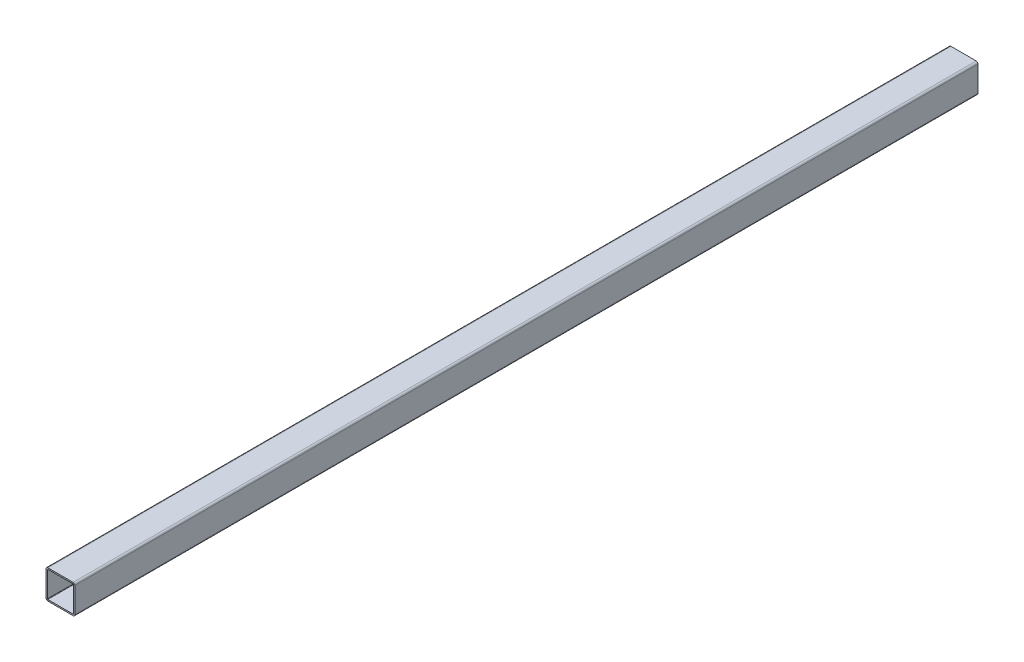
ISO-10303-21;
HEADER;
FILE_DESCRIPTION(('STEP AP214'),'2;1');
FILE_NAME('part.step','',(''),(''),'','','');
FILE_SCHEMA(('AUTOMOTIVE_DESIGN { 1 0 10303 214 1 1 1 1 }'));
ENDSEC;
DATA;
#1=APPLICATION_CONTEXT('core data for automotive mechanical design processes');
#2=APPLICATION_PROTOCOL_DEFINITION('international standard','automotive_design',2000,#1);
#3=PRODUCT_CONTEXT('',#1,'mechanical');
#4=PRODUCT('Part','Part','',(#3));
#5=PRODUCT_RELATED_PRODUCT_CATEGORY('part','',(#4));
#6=PRODUCT_DEFINITION_FORMATION('','',#4);
#7=PRODUCT_DEFINITION_CONTEXT('part definition',#1,'design');
#8=PRODUCT_DEFINITION('design','',#6,#7);
#9=PRODUCT_DEFINITION_SHAPE('','',#8);
#10=(LENGTH_UNIT() NAMED_UNIT(*) SI_UNIT(.MILLI.,.METRE.));
#11=(NAMED_UNIT(*) PLANE_ANGLE_UNIT() SI_UNIT($,.RADIAN.));
#12=(NAMED_UNIT(*) SI_UNIT($,.STERADIAN.) SOLID_ANGLE_UNIT());
#13=UNCERTAINTY_MEASURE_WITH_UNIT(LENGTH_MEASURE(1.E-05),#10,'distance_accuracy_value','');
#14=(GEOMETRIC_REPRESENTATION_CONTEXT(3) GLOBAL_UNCERTAINTY_ASSIGNED_CONTEXT((#13)) GLOBAL_UNIT_ASSIGNED_CONTEXT((#10,
#11,#12)) REPRESENTATION_CONTEXT('',''));
#15=CARTESIAN_POINT('',(0.,0.,0.));
#16=DIRECTION('',(0.,0.,1.));
#17=DIRECTION('',(1.,0.,0.));
#18=AXIS2_PLACEMENT_3D('',#15,#16,#17);
#19=CARTESIAN_POINT('',(14.,-14.,-500.));
#20=DIRECTION('',(0.,0.,1.));
#21=DIRECTION('',(1.,0.,0.));
#22=AXIS2_PLACEMENT_3D('',#19,#20,#21);
#23=CYLINDRICAL_SURFACE('',#22,2.);
#24=DIRECTION('',(0.,0.,1.));
#25=VECTOR('',#24,1.);
#26=CARTESIAN_POINT('',(16.,-14.,-500.));
#27=LINE('',#26,#25);
#28=CARTESIAN_POINT('',(16.,-14.,-500.));
#29=VERTEX_POINT('',#28);
#30=CARTESIAN_POINT('',(16.,-14.,500.));
#31=VERTEX_POINT('',#30);
#32=EDGE_CURVE('E39',#29,#31,#27,.T.);
#33=ORIENTED_EDGE('',*,*,#32,.T.);
#34=CARTESIAN_POINT('',(14.,-14.,500.));
#35=DIRECTION('',(0.,0.,1.));
#36=DIRECTION('',(1.,0.,0.));
#37=AXIS2_PLACEMENT_3D('',#34,#35,#36);
#38=CIRCLE('',#37,2.);
#39=CARTESIAN_POINT('',(14.,-16.,500.));
#40=VERTEX_POINT('',#39);
#41=EDGE_CURVE('E192',#40,#31,#38,.T.);
#42=ORIENTED_EDGE('',*,*,#41,.F.);
#43=DIRECTION('',(0.,0.,1.));
#44=VECTOR('',#43,1.);
#45=CARTESIAN_POINT('',(14.,-16.,-500.));
#46=LINE('',#45,#44);
#47=CARTESIAN_POINT('',(14.,-16.,-500.));
#48=VERTEX_POINT('',#47);
#49=EDGE_CURVE('E11',#48,#40,#46,.T.);
#50=ORIENTED_EDGE('',*,*,#49,.F.);
#51=CARTESIAN_POINT('',(14.,-14.,-500.));
#52=DIRECTION('',(0.,0.,1.));
#53=DIRECTION('',(1.,0.,0.));
#54=AXIS2_PLACEMENT_3D('',#51,#52,#53);
#55=CIRCLE('',#54,2.);
#56=EDGE_CURVE('E235',#48,#29,#55,.T.);
#57=ORIENTED_EDGE('',*,*,#56,.T.);
#58=EDGE_LOOP('',(#33,#42,#50,#57));
#59=FACE_BOUND('',#58,.T.);
#60=ADVANCED_FACE('F36',(#59),#23,.T.);
#61=CARTESIAN_POINT('',(-14.,-16.,-500.));
#62=DIRECTION('',(0.,-1.,0.));
#63=DIRECTION('',(0.,0.,-1.));
#64=AXIS2_PLACEMENT_3D('',#61,#62,#63);
#65=PLANE('',#64);
#66=ORIENTED_EDGE('',*,*,#49,.T.);
#67=DIRECTION('',(1.,0.,0.));
#68=VECTOR('',#67,1.);
#69=CARTESIAN_POINT('',(-14.,-16.,500.));
#70=LINE('',#69,#68);
#71=CARTESIAN_POINT('',(-14.,-16.,500.));
#72=VERTEX_POINT('',#71);
#73=EDGE_CURVE('E213',#72,#40,#70,.T.);
#74=ORIENTED_EDGE('',*,*,#73,.F.);
#75=DIRECTION('',(0.,0.,1.));
#76=VECTOR('',#75,1.);
#77=CARTESIAN_POINT('',(-14.,-16.,-500.));
#78=LINE('',#77,#76);
#79=CARTESIAN_POINT('',(-14.,-16.,-500.));
#80=VERTEX_POINT('',#79);
#81=EDGE_CURVE('E44',#80,#72,#78,.T.);
#82=ORIENTED_EDGE('',*,*,#81,.F.);
#83=DIRECTION('',(1.,0.,0.));
#84=VECTOR('',#83,1.);
#85=CARTESIAN_POINT('',(-14.,-16.,-500.));
#86=LINE('',#85,#84);
#87=EDGE_CURVE('E266',#80,#48,#86,.T.);
#88=ORIENTED_EDGE('',*,*,#87,.T.);
#89=EDGE_LOOP('',(#66,#74,#82,#88));
#90=FACE_BOUND('',#89,.T.);
#91=ADVANCED_FACE('F287',(#90),#65,.T.);
#92=CARTESIAN_POINT('',(-14.,-14.,-500.));
#93=DIRECTION('',(0.,0.,1.));
#94=DIRECTION('',(1.,0.,0.));
#95=AXIS2_PLACEMENT_3D('',#92,#93,#94);
#96=CYLINDRICAL_SURFACE('',#95,2.);
#97=ORIENTED_EDGE('',*,*,#81,.T.);
#98=CARTESIAN_POINT('',(-14.,-14.,500.));
#99=DIRECTION('',(0.,0.,1.));
#100=DIRECTION('',(1.,0.,0.));
#101=AXIS2_PLACEMENT_3D('',#98,#99,#100);
#102=CIRCLE('',#101,2.);
#103=CARTESIAN_POINT('',(-16.,-14.,500.));
#104=VERTEX_POINT('',#103);
#105=EDGE_CURVE('E210',#104,#72,#102,.T.);
#106=ORIENTED_EDGE('',*,*,#105,.F.);
#107=DIRECTION('',(0.,0.,1.));
#108=VECTOR('',#107,1.);
#109=CARTESIAN_POINT('',(-16.,-14.,-500.));
#110=LINE('',#109,#108);
#111=CARTESIAN_POINT('',(-16.,-14.,-500.));
#112=VERTEX_POINT('',#111);
#113=EDGE_CURVE('E270',#112,#104,#110,.T.);
#114=ORIENTED_EDGE('',*,*,#113,.F.);
#115=CARTESIAN_POINT('',(-14.,-14.,-500.));
#116=DIRECTION('',(0.,0.,1.));
#117=DIRECTION('',(1.,0.,0.));
#118=AXIS2_PLACEMENT_3D('',#115,#116,#117);
#119=CIRCLE('',#118,2.);
#120=EDGE_CURVE('E263',#112,#80,#119,.T.);
#121=ORIENTED_EDGE('',*,*,#120,.T.);
#122=EDGE_LOOP('',(#97,#106,#114,#121));
#123=FACE_BOUND('',#122,.T.);
#124=ADVANCED_FACE('F308',(#123),#96,.T.);
#125=CARTESIAN_POINT('',(-16.,-14.,-500.));
#126=DIRECTION('',(-1.,0.,0.));
#127=DIRECTION('',(0.,0.,1.));
#128=AXIS2_PLACEMENT_3D('',#125,#126,#127);
#129=PLANE('',#128);
#130=ORIENTED_EDGE('',*,*,#113,.T.);
#131=DIRECTION('',(0.,-1.,0.));
#132=VECTOR('',#131,1.);
#133=CARTESIAN_POINT('',(-16.,-14.,500.));
#134=LINE('',#133,#132);
#135=CARTESIAN_POINT('',(-16.,14.,500.));
#136=VERTEX_POINT('',#135);
#137=EDGE_CURVE('E207',#136,#104,#134,.T.);
#138=ORIENTED_EDGE('',*,*,#137,.F.);
#139=DIRECTION('',(0.,0.,1.));
#140=VECTOR('',#139,1.);
#141=CARTESIAN_POINT('',(-16.,14.,-500.));
#142=LINE('',#141,#140);
#143=CARTESIAN_POINT('',(-16.,14.,-500.));
#144=VERTEX_POINT('',#143);
#145=EDGE_CURVE('E272',#144,#136,#142,.T.);
#146=ORIENTED_EDGE('',*,*,#145,.F.);
#147=DIRECTION('',(0.,-1.,0.));
#148=VECTOR('',#147,1.);
#149=CARTESIAN_POINT('',(-16.,-14.,-500.));
#150=LINE('',#149,#148);
#151=EDGE_CURVE('E260',#144,#112,#150,.T.);
#152=ORIENTED_EDGE('',*,*,#151,.T.);
#153=EDGE_LOOP('',(#130,#138,#146,#152));
#154=FACE_BOUND('',#153,.T.);
#155=ADVANCED_FACE('F305',(#154),#129,.T.);
#156=CARTESIAN_POINT('',(-14.,14.,-500.));
#157=DIRECTION('',(0.,0.,1.));
#158=DIRECTION('',(1.,0.,0.));
#159=AXIS2_PLACEMENT_3D('',#156,#157,#158);
#160=CYLINDRICAL_SURFACE('',#159,2.);
#161=ORIENTED_EDGE('',*,*,#145,.T.);
#162=CARTESIAN_POINT('',(-14.,14.,500.));
#163=DIRECTION('',(0.,0.,1.));
#164=DIRECTION('',(-1.,0.,0.));
#165=AXIS2_PLACEMENT_3D('',#162,#163,#164);
#166=CIRCLE('',#165,2.);
#167=CARTESIAN_POINT('',(-14.,16.,500.));
#168=VERTEX_POINT('',#167);
#169=EDGE_CURVE('E204',#168,#136,#166,.T.);
#170=ORIENTED_EDGE('',*,*,#169,.F.);
#171=DIRECTION('',(0.,0.,1.));
#172=VECTOR('',#171,1.);
#173=CARTESIAN_POINT('',(-14.,16.,-500.));
#174=LINE('',#173,#172);
#175=CARTESIAN_POINT('',(-14.,16.,-500.));
#176=VERTEX_POINT('',#175);
#177=EDGE_CURVE('E274',#176,#168,#174,.T.);
#178=ORIENTED_EDGE('',*,*,#177,.F.);
#179=CARTESIAN_POINT('',(-14.,14.,-500.));
#180=DIRECTION('',(0.,0.,1.));
#181=DIRECTION('',(-1.,0.,0.));
#182=AXIS2_PLACEMENT_3D('',#179,#180,#181);
#183=CIRCLE('',#182,2.);
#184=EDGE_CURVE('E257',#176,#144,#183,.T.);
#185=ORIENTED_EDGE('',*,*,#184,.T.);
#186=EDGE_LOOP('',(#161,#170,#178,#185));
#187=FACE_BOUND('',#186,.T.);
#188=ADVANCED_FACE('F303',(#187),#160,.T.);
#189=CARTESIAN_POINT('',(-14.,16.,-500.));
#190=DIRECTION('',(0.,1.,0.));
#191=DIRECTION('',(0.,0.,1.));
#192=AXIS2_PLACEMENT_3D('',#189,#190,#191);
#193=PLANE('',#192);
#194=ORIENTED_EDGE('',*,*,#177,.T.);
#195=DIRECTION('',(-1.,0.,0.));
#196=VECTOR('',#195,1.);
#197=CARTESIAN_POINT('',(-14.,16.,500.));
#198=LINE('',#197,#196);
#199=CARTESIAN_POINT('',(14.,16.,500.));
#200=VERTEX_POINT('',#199);
#201=EDGE_CURVE('E201',#200,#168,#198,.T.);
#202=ORIENTED_EDGE('',*,*,#201,.F.);
#203=DIRECTION('',(0.,0.,1.));
#204=VECTOR('',#203,1.);
#205=CARTESIAN_POINT('',(14.,16.,-500.));
#206=LINE('',#205,#204);
#207=CARTESIAN_POINT('',(14.,16.,-500.));
#208=VERTEX_POINT('',#207);
#209=EDGE_CURVE('E276',#208,#200,#206,.T.);
#210=ORIENTED_EDGE('',*,*,#209,.F.);
#211=DIRECTION('',(-1.,0.,0.));
#212=VECTOR('',#211,1.);
#213=CARTESIAN_POINT('',(-14.,16.,-500.));
#214=LINE('',#213,#212);
#215=EDGE_CURVE('E254',#208,#176,#214,.T.);
#216=ORIENTED_EDGE('',*,*,#215,.T.);
#217=EDGE_LOOP('',(#194,#202,#210,#216));
#218=FACE_BOUND('',#217,.T.);
#219=ADVANCED_FACE('F301',(#218),#193,.T.);
#220=CARTESIAN_POINT('',(14.,14.,-500.));
#221=DIRECTION('',(0.,0.,1.));
#222=DIRECTION('',(1.,0.,0.));
#223=AXIS2_PLACEMENT_3D('',#220,#221,#222);
#224=CYLINDRICAL_SURFACE('',#223,2.);
#225=ORIENTED_EDGE('',*,*,#209,.T.);
#226=CARTESIAN_POINT('',(14.,14.,500.));
#227=DIRECTION('',(0.,0.,1.));
#228=DIRECTION('',(1.,0.,0.));
#229=AXIS2_PLACEMENT_3D('',#226,#227,#228);
#230=CIRCLE('',#229,2.);
#231=CARTESIAN_POINT('',(16.,14.,500.));
#232=VERTEX_POINT('',#231);
#233=EDGE_CURVE('E198',#232,#200,#230,.T.);
#234=ORIENTED_EDGE('',*,*,#233,.F.);
#235=DIRECTION('',(0.,0.,1.));
#236=VECTOR('',#235,1.);
#237=CARTESIAN_POINT('',(16.,14.,-500.));
#238=LINE('',#237,#236);
#239=CARTESIAN_POINT('',(16.,14.,-500.));
#240=VERTEX_POINT('',#239);
#241=EDGE_CURVE('E277',#240,#232,#238,.T.);
#242=ORIENTED_EDGE('',*,*,#241,.F.);
#243=CARTESIAN_POINT('',(14.,14.,-500.));
#244=DIRECTION('',(0.,0.,1.));
#245=DIRECTION('',(1.,0.,0.));
#246=AXIS2_PLACEMENT_3D('',#243,#244,#245);
#247=CIRCLE('',#246,2.);
#248=EDGE_CURVE('E251',#240,#208,#247,.T.);
#249=ORIENTED_EDGE('',*,*,#248,.T.);
#250=EDGE_LOOP('',(#225,#234,#242,#249));
#251=FACE_BOUND('',#250,.T.);
#252=ADVANCED_FACE('F297',(#251),#224,.T.);
#253=CARTESIAN_POINT('',(16.,-14.,-500.));
#254=DIRECTION('',(1.,0.,0.));
#255=DIRECTION('',(0.,0.,-1.));
#256=AXIS2_PLACEMENT_3D('',#253,#254,#255);
#257=PLANE('',#256);
#258=ORIENTED_EDGE('',*,*,#241,.T.);
#259=DIRECTION('',(0.,1.,0.));
#260=VECTOR('',#259,1.);
#261=CARTESIAN_POINT('',(16.,-14.,500.));
#262=LINE('',#261,#260);
#263=EDGE_CURVE('E195',#31,#232,#262,.T.);
#264=ORIENTED_EDGE('',*,*,#263,.F.);
#265=ORIENTED_EDGE('',*,*,#32,.F.);
#266=DIRECTION('',(0.,1.,0.));
#267=VECTOR('',#266,1.);
#268=CARTESIAN_POINT('',(16.,-14.,-500.));
#269=LINE('',#268,#267);
#270=EDGE_CURVE('E248',#29,#240,#269,.T.);
#271=ORIENTED_EDGE('',*,*,#270,.T.);
#272=EDGE_LOOP('',(#258,#264,#265,#271));
#273=FACE_BOUND('',#272,.T.);
#274=ADVANCED_FACE('F281',(#273),#257,.T.);
#275=CARTESIAN_POINT('',(14.,-14.,-500.));
#276=DIRECTION('',(0.,0.,1.));
#277=DIRECTION('',(1.,0.,0.));
#278=AXIS2_PLACEMENT_3D('',#275,#276,#277);
#279=PLANE('',#278);
#280=DIRECTION('',(-1.,0.,0.));
#281=VECTOR('',#280,1.);
#282=CARTESIAN_POINT('',(-14.,14.48,-500.));
#283=LINE('',#282,#281);
#284=CARTESIAN_POINT('',(14.,14.48,-500.));
#285=VERTEX_POINT('',#284);
#286=CARTESIAN_POINT('',(-14.,14.48,-500.));
#287=VERTEX_POINT('',#286);
#288=EDGE_CURVE('E161',#285,#287,#283,.T.);
#289=ORIENTED_EDGE('',*,*,#288,.T.);
#290=CARTESIAN_POINT('',(-14.,14.,-500.));
#291=DIRECTION('',(0.,0.,1.));
#292=DIRECTION('',(-1.,0.,0.));
#293=AXIS2_PLACEMENT_3D('',#290,#291,#292);
#294=CIRCLE('',#293,0.48);
#295=CARTESIAN_POINT('',(-14.48,14.,-500.));
#296=VERTEX_POINT('',#295);
#297=EDGE_CURVE('E216',#287,#296,#294,.T.);
#298=ORIENTED_EDGE('',*,*,#297,.T.);
#299=DIRECTION('',(0.,-1.,0.));
#300=VECTOR('',#299,1.);
#301=CARTESIAN_POINT('',(-14.48,-14.,-500.));
#302=LINE('',#301,#300);
#303=CARTESIAN_POINT('',(-14.48,-14.,-500.));
#304=VERTEX_POINT('',#303);
#305=EDGE_CURVE('E156',#296,#304,#302,.T.);
#306=ORIENTED_EDGE('',*,*,#305,.T.);
#307=CARTESIAN_POINT('',(-14.,-14.,-500.));
#308=DIRECTION('',(0.,0.,1.));
#309=DIRECTION('',(1.,0.,0.));
#310=AXIS2_PLACEMENT_3D('',#307,#308,#309);
#311=CIRCLE('',#310,0.48);
#312=CARTESIAN_POINT('',(-14.,-14.48,-500.));
#313=VERTEX_POINT('',#312);
#314=EDGE_CURVE('E52',#304,#313,#311,.T.);
#315=ORIENTED_EDGE('',*,*,#314,.T.);
#316=DIRECTION('',(1.,0.,0.));
#317=VECTOR('',#316,1.);
#318=CARTESIAN_POINT('',(-14.,-14.48,-500.));
#319=LINE('',#318,#317);
#320=CARTESIAN_POINT('',(14.,-14.48,-500.));
#321=VERTEX_POINT('',#320);
#322=EDGE_CURVE('E220',#313,#321,#319,.T.);
#323=ORIENTED_EDGE('',*,*,#322,.T.);
#324=CARTESIAN_POINT('',(14.,-14.,-500.));
#325=DIRECTION('',(0.,0.,1.));
#326=DIRECTION('',(1.,0.,0.));
#327=AXIS2_PLACEMENT_3D('',#324,#325,#326);
#328=CIRCLE('',#327,0.48);
#329=CARTESIAN_POINT('',(14.48,-14.,-500.));
#330=VERTEX_POINT('',#329);
#331=EDGE_CURVE('E223',#321,#330,#328,.T.);
#332=ORIENTED_EDGE('',*,*,#331,.T.);
#333=DIRECTION('',(0.,1.,0.));
#334=VECTOR('',#333,1.);
#335=CARTESIAN_POINT('',(14.48,-14.,-500.));
#336=LINE('',#335,#334);
#337=CARTESIAN_POINT('',(14.48,14.,-500.));
#338=VERTEX_POINT('',#337);
#339=EDGE_CURVE('E226',#330,#338,#336,.T.);
#340=ORIENTED_EDGE('',*,*,#339,.T.);
#341=CARTESIAN_POINT('',(14.,14.,-500.));
#342=DIRECTION('',(0.,0.,1.));
#343=DIRECTION('',(1.,0.,0.));
#344=AXIS2_PLACEMENT_3D('',#341,#342,#343);
#345=CIRCLE('',#344,0.48);
#346=EDGE_CURVE('E229',#338,#285,#345,.T.);
#347=ORIENTED_EDGE('',*,*,#346,.T.);
#348=EDGE_LOOP('',(#289,#298,#306,#315,#323,#332,#340,#347));
#349=FACE_BOUND('',#348,.T.);
#350=ORIENTED_EDGE('',*,*,#56,.F.);
#351=ORIENTED_EDGE('',*,*,#87,.F.);
#352=ORIENTED_EDGE('',*,*,#120,.F.);
#353=ORIENTED_EDGE('',*,*,#151,.F.);
#354=ORIENTED_EDGE('',*,*,#184,.F.);
#355=ORIENTED_EDGE('',*,*,#215,.F.);
#356=ORIENTED_EDGE('',*,*,#248,.F.);
#357=ORIENTED_EDGE('',*,*,#270,.F.);
#358=EDGE_LOOP('',(#350,#351,#352,#353,#354,#355,#356,#357));
#359=FACE_BOUND('',#358,.T.);
#360=ADVANCED_FACE('F291',(#349,#359),#279,.F.);
#361=CARTESIAN_POINT('',(-14.,14.,-500.));
#362=DIRECTION('',(0.,0.,1.));
#363=DIRECTION('',(1.,0.,0.));
#364=AXIS2_PLACEMENT_3D('',#361,#362,#363);
#365=CYLINDRICAL_SURFACE('',#364,0.48);
#366=DIRECTION('',(0.,0.,1.));
#367=VECTOR('',#366,1.);
#368=CARTESIAN_POINT('',(-14.,14.48,-500.));
#369=LINE('',#368,#367);
#370=CARTESIAN_POINT('',(-14.,14.48,500.));
#371=VERTEX_POINT('',#370);
#372=EDGE_CURVE('E166',#287,#371,#369,.T.);
#373=ORIENTED_EDGE('',*,*,#372,.T.);
#374=CARTESIAN_POINT('',(-14.,14.,500.));
#375=DIRECTION('',(0.,0.,1.));
#376=DIRECTION('',(-1.,0.,0.));
#377=AXIS2_PLACEMENT_3D('',#374,#375,#376);
#378=CIRCLE('',#377,0.48);
#379=CARTESIAN_POINT('',(-14.48,14.,500.));
#380=VERTEX_POINT('',#379);
#381=EDGE_CURVE('E164',#371,#380,#378,.T.);
#382=ORIENTED_EDGE('',*,*,#381,.T.);
#383=DIRECTION('',(0.,0.,1.));
#384=VECTOR('',#383,1.);
#385=CARTESIAN_POINT('',(-14.48,14.,-500.));
#386=LINE('',#385,#384);
#387=EDGE_CURVE('E149',#296,#380,#386,.T.);
#388=ORIENTED_EDGE('',*,*,#387,.F.);
#389=ORIENTED_EDGE('',*,*,#297,.F.);
#390=EDGE_LOOP('',(#373,#382,#388,#389));
#391=FACE_BOUND('',#390,.T.);
#392=ADVANCED_FACE('F165',(#391),#365,.F.);
#393=CARTESIAN_POINT('',(-14.,14.48,-500.));
#394=DIRECTION('',(0.,1.,0.));
#395=DIRECTION('',(0.,0.,1.));
#396=AXIS2_PLACEMENT_3D('',#393,#394,#395);
#397=PLANE('',#396);
#398=DIRECTION('',(0.,0.,1.));
#399=VECTOR('',#398,1.);
#400=CARTESIAN_POINT('',(14.,14.48,-500.));
#401=LINE('',#400,#399);
#402=CARTESIAN_POINT('',(14.,14.48,500.));
#403=VERTEX_POINT('',#402);
#404=EDGE_CURVE('E236',#285,#403,#401,.T.);
#405=ORIENTED_EDGE('',*,*,#404,.T.);
#406=DIRECTION('',(-1.,0.,0.));
#407=VECTOR('',#406,1.);
#408=CARTESIAN_POINT('',(-14.,14.48,500.));
#409=LINE('',#408,#407);
#410=EDGE_CURVE('E190',#403,#371,#409,.T.);
#411=ORIENTED_EDGE('',*,*,#410,.T.);
#412=ORIENTED_EDGE('',*,*,#372,.F.);
#413=ORIENTED_EDGE('',*,*,#288,.F.);
#414=EDGE_LOOP('',(#405,#411,#412,#413));
#415=FACE_BOUND('',#414,.T.);
#416=ADVANCED_FACE('F383',(#415),#397,.F.);
#417=CARTESIAN_POINT('',(14.,14.,-500.));
#418=DIRECTION('',(0.,0.,1.));
#419=DIRECTION('',(1.,0.,0.));
#420=AXIS2_PLACEMENT_3D('',#417,#418,#419);
#421=CYLINDRICAL_SURFACE('',#420,0.48);
#422=DIRECTION('',(0.,0.,1.));
#423=VECTOR('',#422,1.);
#424=CARTESIAN_POINT('',(14.48,14.,-500.));
#425=LINE('',#424,#423);
#426=CARTESIAN_POINT('',(14.48,14.,500.));
#427=VERTEX_POINT('',#426);
#428=EDGE_CURVE('E238',#338,#427,#425,.T.);
#429=ORIENTED_EDGE('',*,*,#428,.T.);
#430=CARTESIAN_POINT('',(14.,14.,500.));
#431=DIRECTION('',(0.,0.,1.));
#432=DIRECTION('',(1.,0.,0.));
#433=AXIS2_PLACEMENT_3D('',#430,#431,#432);
#434=CIRCLE('',#433,0.48);
#435=EDGE_CURVE('E187',#427,#403,#434,.T.);
#436=ORIENTED_EDGE('',*,*,#435,.T.);
#437=ORIENTED_EDGE('',*,*,#404,.F.);
#438=ORIENTED_EDGE('',*,*,#346,.F.);
#439=EDGE_LOOP('',(#429,#436,#437,#438));
#440=FACE_BOUND('',#439,.T.);
#441=ADVANCED_FACE('F392',(#440),#421,.F.);
#442=CARTESIAN_POINT('',(14.48,-14.,-500.));
#443=DIRECTION('',(1.,0.,0.));
#444=DIRECTION('',(0.,0.,-1.));
#445=AXIS2_PLACEMENT_3D('',#442,#443,#444);
#446=PLANE('',#445);
#447=DIRECTION('',(0.,0.,1.));
#448=VECTOR('',#447,1.);
#449=CARTESIAN_POINT('',(14.48,-14.,-500.));
#450=LINE('',#449,#448);
#451=CARTESIAN_POINT('',(14.48,-14.,500.));
#452=VERTEX_POINT('',#451);
#453=EDGE_CURVE('E240',#330,#452,#450,.T.);
#454=ORIENTED_EDGE('',*,*,#453,.T.);
#455=DIRECTION('',(0.,1.,0.));
#456=VECTOR('',#455,1.);
#457=CARTESIAN_POINT('',(14.48,-14.,500.));
#458=LINE('',#457,#456);
#459=EDGE_CURVE('E184',#452,#427,#458,.T.);
#460=ORIENTED_EDGE('',*,*,#459,.T.);
#461=ORIENTED_EDGE('',*,*,#428,.F.);
#462=ORIENTED_EDGE('',*,*,#339,.F.);
#463=EDGE_LOOP('',(#454,#460,#461,#462));
#464=FACE_BOUND('',#463,.T.);
#465=ADVANCED_FACE('F402',(#464),#446,.F.);
#466=CARTESIAN_POINT('',(14.,-14.,-500.));
#467=DIRECTION('',(0.,0.,1.));
#468=DIRECTION('',(1.,0.,0.));
#469=AXIS2_PLACEMENT_3D('',#466,#467,#468);
#470=CYLINDRICAL_SURFACE('',#469,0.48);
#471=DIRECTION('',(0.,0.,1.));
#472=VECTOR('',#471,1.);
#473=CARTESIAN_POINT('',(14.,-14.48,-500.));
#474=LINE('',#473,#472);
#475=CARTESIAN_POINT('',(14.,-14.48,500.));
#476=VERTEX_POINT('',#475);
#477=EDGE_CURVE('E242',#321,#476,#474,.T.);
#478=ORIENTED_EDGE('',*,*,#477,.T.);
#479=CARTESIAN_POINT('',(14.,-14.,500.));
#480=DIRECTION('',(0.,0.,1.));
#481=DIRECTION('',(1.,0.,0.));
#482=AXIS2_PLACEMENT_3D('',#479,#480,#481);
#483=CIRCLE('',#482,0.48);
#484=EDGE_CURVE('E181',#476,#452,#483,.T.);
#485=ORIENTED_EDGE('',*,*,#484,.T.);
#486=ORIENTED_EDGE('',*,*,#453,.F.);
#487=ORIENTED_EDGE('',*,*,#331,.F.);
#488=EDGE_LOOP('',(#478,#485,#486,#487));
#489=FACE_BOUND('',#488,.T.);
#490=ADVANCED_FACE('F412',(#489),#470,.F.);
#491=CARTESIAN_POINT('',(-14.,-14.48,-500.));
#492=DIRECTION('',(0.,-1.,0.));
#493=DIRECTION('',(0.,0.,-1.));
#494=AXIS2_PLACEMENT_3D('',#491,#492,#493);
#495=PLANE('',#494);
#496=DIRECTION('',(0.,0.,1.));
#497=VECTOR('',#496,1.);
#498=CARTESIAN_POINT('',(-14.,-14.48,-500.));
#499=LINE('',#498,#497);
#500=CARTESIAN_POINT('',(-14.,-14.48,500.));
#501=VERTEX_POINT('',#500);
#502=EDGE_CURVE('E244',#313,#501,#499,.T.);
#503=ORIENTED_EDGE('',*,*,#502,.T.);
#504=DIRECTION('',(1.,0.,0.));
#505=VECTOR('',#504,1.);
#506=CARTESIAN_POINT('',(-14.,-14.48,500.));
#507=LINE('',#506,#505);
#508=EDGE_CURVE('E176',#501,#476,#507,.T.);
#509=ORIENTED_EDGE('',*,*,#508,.T.);
#510=ORIENTED_EDGE('',*,*,#477,.F.);
#511=ORIENTED_EDGE('',*,*,#322,.F.);
#512=EDGE_LOOP('',(#503,#509,#510,#511));
#513=FACE_BOUND('',#512,.T.);
#514=ADVANCED_FACE('F422',(#513),#495,.F.);
#515=CARTESIAN_POINT('',(-14.,-14.,-500.));
#516=DIRECTION('',(0.,0.,1.));
#517=DIRECTION('',(1.,0.,0.));
#518=AXIS2_PLACEMENT_3D('',#515,#516,#517);
#519=CYLINDRICAL_SURFACE('',#518,0.48);
#520=DIRECTION('',(0.,0.,1.));
#521=VECTOR('',#520,1.);
#522=CARTESIAN_POINT('',(-14.48,-14.,-500.));
#523=LINE('',#522,#521);
#524=CARTESIAN_POINT('',(-14.48,-14.,500.));
#525=VERTEX_POINT('',#524);
#526=EDGE_CURVE('E160',#304,#525,#523,.T.);
#527=ORIENTED_EDGE('',*,*,#526,.T.);
#528=CARTESIAN_POINT('',(-14.,-14.,500.));
#529=DIRECTION('',(0.,0.,1.));
#530=DIRECTION('',(1.,0.,0.));
#531=AXIS2_PLACEMENT_3D('',#528,#529,#530);
#532=CIRCLE('',#531,0.48);
#533=EDGE_CURVE('E174',#525,#501,#532,.T.);
#534=ORIENTED_EDGE('',*,*,#533,.T.);
#535=ORIENTED_EDGE('',*,*,#502,.F.);
#536=ORIENTED_EDGE('',*,*,#314,.F.);
#537=EDGE_LOOP('',(#527,#534,#535,#536));
#538=FACE_BOUND('',#537,.T.);
#539=ADVANCED_FACE('F432',(#538),#519,.F.);
#540=CARTESIAN_POINT('',(-14.48,-14.,-500.));
#541=DIRECTION('',(-1.,0.,0.));
#542=DIRECTION('',(0.,0.,1.));
#543=AXIS2_PLACEMENT_3D('',#540,#541,#542);
#544=PLANE('',#543);
#545=ORIENTED_EDGE('',*,*,#387,.T.);
#546=DIRECTION('',(0.,-1.,0.));
#547=VECTOR('',#546,1.);
#548=CARTESIAN_POINT('',(-14.48,-14.,500.));
#549=LINE('',#548,#547);
#550=EDGE_CURVE('E153',#380,#525,#549,.T.);
#551=ORIENTED_EDGE('',*,*,#550,.T.);
#552=ORIENTED_EDGE('',*,*,#526,.F.);
#553=ORIENTED_EDGE('',*,*,#305,.F.);
#554=EDGE_LOOP('',(#545,#551,#552,#553));
#555=FACE_BOUND('',#554,.T.);
#556=ADVANCED_FACE('F151',(#555),#544,.F.);
#557=CARTESIAN_POINT('',(14.,-14.,500.));
#558=DIRECTION('',(0.,0.,1.));
#559=DIRECTION('',(1.,0.,0.));
#560=AXIS2_PLACEMENT_3D('',#557,#558,#559);
#561=PLANE('',#560);
#562=ORIENTED_EDGE('',*,*,#41,.T.);
#563=ORIENTED_EDGE('',*,*,#263,.T.);
#564=ORIENTED_EDGE('',*,*,#233,.T.);
#565=ORIENTED_EDGE('',*,*,#201,.T.);
#566=ORIENTED_EDGE('',*,*,#169,.T.);
#567=ORIENTED_EDGE('',*,*,#137,.T.);
#568=ORIENTED_EDGE('',*,*,#105,.T.);
#569=ORIENTED_EDGE('',*,*,#73,.T.);
#570=EDGE_LOOP('',(#562,#563,#564,#565,#566,#567,#568,#569));
#571=FACE_BOUND('',#570,.T.);
#572=ORIENTED_EDGE('',*,*,#550,.F.);
#573=ORIENTED_EDGE('',*,*,#381,.F.);
#574=ORIENTED_EDGE('',*,*,#410,.F.);
#575=ORIENTED_EDGE('',*,*,#435,.F.);
#576=ORIENTED_EDGE('',*,*,#459,.F.);
#577=ORIENTED_EDGE('',*,*,#484,.F.);
#578=ORIENTED_EDGE('',*,*,#508,.F.);
#579=ORIENTED_EDGE('',*,*,#533,.F.);
#580=EDGE_LOOP('',(#572,#573,#574,#575,#576,#577,#578,#579));
#581=FACE_BOUND('',#580,.T.);
#582=ADVANCED_FACE('F171',(#571,#581),#561,.T.);
#583=CLOSED_SHELL('',(#60,#91,#124,#155,#188,#219,#252,#274,#360,#392,#416,#441,#465,#490,#514,
#539,#556,#582));
#584=MANIFOLD_SOLID_BREP('B2',#583);
#585=ADVANCED_BREP_SHAPE_REPRESENTATION('',(#18,#584),#14);
#586=SHAPE_DEFINITION_REPRESENTATION(#9,#585);
ENDSEC;
END-ISO-10303-21;
